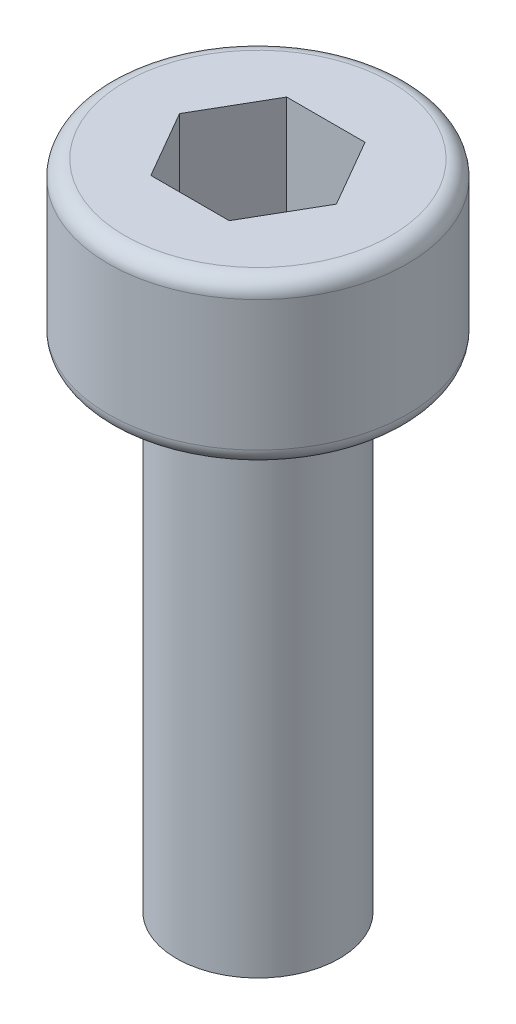
ISO-10303-21;
HEADER;
FILE_DESCRIPTION(('STEP AP214'),'2;1');
FILE_NAME('part.step','',(''),(''),'','','');
FILE_SCHEMA(('AUTOMOTIVE_DESIGN { 1 0 10303 214 1 1 1 1 }'));
ENDSEC;
DATA;
#1=APPLICATION_CONTEXT('core data for automotive mechanical design processes');
#2=APPLICATION_PROTOCOL_DEFINITION('international standard','automotive_design',2000,#1);
#3=PRODUCT_CONTEXT('',#1,'mechanical');
#4=PRODUCT('Part','Part','',(#3));
#5=PRODUCT_RELATED_PRODUCT_CATEGORY('part','',(#4));
#6=PRODUCT_DEFINITION_FORMATION('','',#4);
#7=PRODUCT_DEFINITION_CONTEXT('part definition',#1,'design');
#8=PRODUCT_DEFINITION('design','',#6,#7);
#9=PRODUCT_DEFINITION_SHAPE('','',#8);
#10=(LENGTH_UNIT() NAMED_UNIT(*) SI_UNIT(.MILLI.,.METRE.));
#11=(NAMED_UNIT(*) PLANE_ANGLE_UNIT() SI_UNIT($,.RADIAN.));
#12=(NAMED_UNIT(*) SI_UNIT($,.STERADIAN.) SOLID_ANGLE_UNIT());
#13=UNCERTAINTY_MEASURE_WITH_UNIT(LENGTH_MEASURE(1.E-05),#10,'distance_accuracy_value','');
#14=(GEOMETRIC_REPRESENTATION_CONTEXT(3) GLOBAL_UNCERTAINTY_ASSIGNED_CONTEXT((#13)) GLOBAL_UNIT_ASSIGNED_CONTEXT((#10,
#11,#12)) REPRESENTATION_CONTEXT('',''));
#15=CARTESIAN_POINT('',(0.,0.,0.));
#16=DIRECTION('',(0.,0.,1.));
#17=DIRECTION('',(1.,0.,0.));
#18=AXIS2_PLACEMENT_3D('',#15,#16,#17);
#19=CARTESIAN_POINT('',(-0.721687836487033,10.,-1.25));
#20=DIRECTION('',(-0.866025403784439,0.,-0.5));
#21=DIRECTION('',(-0.5,0.,0.866025403784439));
#22=AXIS2_PLACEMENT_3D('',#19,#20,#21);
#23=PLANE('',#22);
#24=DIRECTION('',(0.,1.,0.));
#25=VECTOR('',#24,1.);
#26=CARTESIAN_POINT('',(-1.44337567297406,10.,0.));
#27=LINE('',#26,#25);
#28=CARTESIAN_POINT('',(-1.44337567297406,12.,0.));
#29=VERTEX_POINT('',#28);
#30=CARTESIAN_POINT('',(-1.44337567297406,10.,0.));
#31=VERTEX_POINT('',#30);
#32=EDGE_CURVE('E102',#29,#31,#27,.F.);
#33=ORIENTED_EDGE('',*,*,#32,.T.);
#34=DIRECTION('',(-0.5,0.,0.866025403784439));
#35=VECTOR('',#34,1.);
#36=CARTESIAN_POINT('',(-0.721687836487033,10.,-1.25));
#37=LINE('',#36,#35);
#38=CARTESIAN_POINT('',(-0.721687836487033,10.,-1.25));
#39=VERTEX_POINT('',#38);
#40=EDGE_CURVE('E91',#39,#31,#37,.T.);
#41=ORIENTED_EDGE('',*,*,#40,.F.);
#42=DIRECTION('',(0.,1.,0.));
#43=VECTOR('',#42,1.);
#44=CARTESIAN_POINT('',(-0.721687836487033,10.,-1.25));
#45=LINE('',#44,#43);
#46=CARTESIAN_POINT('',(-0.721687836487033,12.,-1.25));
#47=VERTEX_POINT('',#46);
#48=EDGE_CURVE('E111',#39,#47,#45,.T.);
#49=ORIENTED_EDGE('',*,*,#48,.T.);
#50=DIRECTION('',(-0.5,0.,0.866025403784439));
#51=VECTOR('',#50,1.);
#52=CARTESIAN_POINT('',(-0.721687836487033,12.,-1.25));
#53=LINE('',#52,#51);
#54=EDGE_CURVE('E86',#29,#47,#53,.F.);
#55=ORIENTED_EDGE('',*,*,#54,.F.);
#56=EDGE_LOOP('',(#33,#41,#49,#55));
#57=FACE_BOUND('',#56,.T.);
#58=ADVANCED_FACE('F16',(#57),#23,.F.);
#59=CARTESIAN_POINT('',(-1.44337567297406,10.,0.));
#60=DIRECTION('',(-0.866025403784439,0.,0.5));
#61=DIRECTION('',(0.5,0.,0.866025403784439));
#62=AXIS2_PLACEMENT_3D('',#59,#60,#61);
#63=PLANE('',#62);
#64=DIRECTION('',(0.,-1.,0.));
#65=VECTOR('',#64,1.);
#66=CARTESIAN_POINT('',(-0.721687836487032,10.,1.25));
#67=LINE('',#66,#65);
#68=CARTESIAN_POINT('',(-0.721687836487032,12.,1.25));
#69=VERTEX_POINT('',#68);
#70=CARTESIAN_POINT('',(-0.721687836487032,10.,1.25));
#71=VERTEX_POINT('',#70);
#72=EDGE_CURVE('E107',#69,#71,#67,.T.);
#73=ORIENTED_EDGE('',*,*,#72,.T.);
#74=DIRECTION('',(0.5,0.,0.866025403784439));
#75=VECTOR('',#74,1.);
#76=CARTESIAN_POINT('',(-1.44337567297406,10.,0.));
#77=LINE('',#76,#75);
#78=EDGE_CURVE('E95',#31,#71,#77,.T.);
#79=ORIENTED_EDGE('',*,*,#78,.F.);
#80=ORIENTED_EDGE('',*,*,#32,.F.);
#81=DIRECTION('',(0.5,0.,0.866025403784439));
#82=VECTOR('',#81,1.);
#83=CARTESIAN_POINT('',(-1.44337567297406,12.,0.));
#84=LINE('',#83,#82);
#85=EDGE_CURVE('E109',#69,#29,#84,.F.);
#86=ORIENTED_EDGE('',*,*,#85,.F.);
#87=EDGE_LOOP('',(#73,#79,#80,#86));
#88=FACE_BOUND('',#87,.T.);
#89=ADVANCED_FACE('F105',(#88),#63,.F.);
#90=CARTESIAN_POINT('',(0.721687836487032,10.,-1.25));
#91=DIRECTION('',(0.,0.,-1.));
#92=DIRECTION('',(-1.,0.,0.));
#93=AXIS2_PLACEMENT_3D('',#90,#91,#92);
#94=PLANE('',#93);
#95=ORIENTED_EDGE('',*,*,#48,.F.);
#96=DIRECTION('',(1.,0.,0.));
#97=VECTOR('',#96,1.);
#98=CARTESIAN_POINT('',(0.,10.,-1.25));
#99=LINE('',#98,#97);
#100=CARTESIAN_POINT('',(0.721687836487031,10.,-1.25));
#101=VERTEX_POINT('',#100);
#102=EDGE_CURVE('E98',#101,#39,#99,.F.);
#103=ORIENTED_EDGE('',*,*,#102,.F.);
#104=DIRECTION('',(0.,1.,0.));
#105=VECTOR('',#104,1.);
#106=CARTESIAN_POINT('',(0.721687836487031,10.,-1.25));
#107=LINE('',#106,#105);
#108=CARTESIAN_POINT('',(0.721687836487031,12.,-1.25));
#109=VERTEX_POINT('',#108);
#110=EDGE_CURVE('E250',#101,#109,#107,.T.);
#111=ORIENTED_EDGE('',*,*,#110,.T.);
#112=DIRECTION('',(-1.,0.,0.));
#113=VECTOR('',#112,1.);
#114=CARTESIAN_POINT('',(0.721687836487032,12.,-1.25));
#115=LINE('',#114,#113);
#116=EDGE_CURVE('E262',#47,#109,#115,.F.);
#117=ORIENTED_EDGE('',*,*,#116,.F.);
#118=EDGE_LOOP('',(#95,#103,#111,#117));
#119=FACE_BOUND('',#118,.T.);
#120=ADVANCED_FACE('F265',(#119),#94,.F.);
#121=CARTESIAN_POINT('',(-0.721687836487032,10.,1.25));
#122=DIRECTION('',(0.,0.,1.));
#123=DIRECTION('',(0.,-1.,0.));
#124=AXIS2_PLACEMENT_3D('',#121,#122,#123);
#125=PLANE('',#124);
#126=DIRECTION('',(0.,1.,0.));
#127=VECTOR('',#126,1.);
#128=CARTESIAN_POINT('',(0.721687836487033,10.,1.25));
#129=LINE('',#128,#127);
#130=CARTESIAN_POINT('',(0.721687836487033,12.,1.25));
#131=VERTEX_POINT('',#130);
#132=CARTESIAN_POINT('',(0.721687836487033,10.,1.25));
#133=VERTEX_POINT('',#132);
#134=EDGE_CURVE('E246',#131,#133,#129,.F.);
#135=ORIENTED_EDGE('',*,*,#134,.T.);
#136=DIRECTION('',(1.,0.,0.));
#137=VECTOR('',#136,1.);
#138=CARTESIAN_POINT('',(0.,10.,1.25));
#139=LINE('',#138,#137);
#140=EDGE_CURVE('E256',#71,#133,#139,.T.);
#141=ORIENTED_EDGE('',*,*,#140,.F.);
#142=ORIENTED_EDGE('',*,*,#72,.F.);
#143=DIRECTION('',(1.,0.,0.));
#144=VECTOR('',#143,1.);
#145=CARTESIAN_POINT('',(-0.721687836487032,12.,1.25));
#146=LINE('',#145,#144);
#147=EDGE_CURVE('E258',#131,#69,#146,.F.);
#148=ORIENTED_EDGE('',*,*,#147,.F.);
#149=EDGE_LOOP('',(#135,#141,#142,#148));
#150=FACE_BOUND('',#149,.T.);
#151=ADVANCED_FACE('F274',(#150),#125,.F.);
#152=CARTESIAN_POINT('',(0.,10.,0.));
#153=DIRECTION('',(0.,1.,0.));
#154=DIRECTION('',(0.,0.,1.));
#155=AXIS2_PLACEMENT_3D('',#152,#153,#154);
#156=PLANE('',#155);
#157=ORIENTED_EDGE('',*,*,#40,.T.);
#158=ORIENTED_EDGE('',*,*,#78,.T.);
#159=ORIENTED_EDGE('',*,*,#140,.T.);
#160=DIRECTION('',(0.5,0.,-0.866025403784439));
#161=VECTOR('',#160,1.);
#162=CARTESIAN_POINT('',(0.721687836487032,10.,1.25));
#163=LINE('',#162,#161);
#164=CARTESIAN_POINT('',(1.44337567297406,10.,0.));
#165=VERTEX_POINT('',#164);
#166=EDGE_CURVE('E244',#133,#165,#163,.T.);
#167=ORIENTED_EDGE('',*,*,#166,.T.);
#168=DIRECTION('',(-0.5,0.,-0.866025403784438));
#169=VECTOR('',#168,1.);
#170=CARTESIAN_POINT('',(1.44337567297406,10.,0.));
#171=LINE('',#170,#169);
#172=EDGE_CURVE('E253',#165,#101,#171,.T.);
#173=ORIENTED_EDGE('',*,*,#172,.T.);
#174=ORIENTED_EDGE('',*,*,#102,.T.);
#175=EDGE_LOOP('',(#157,#158,#159,#167,#173,#174));
#176=FACE_BOUND('',#175,.T.);
#177=ADVANCED_FACE('F92',(#176),#156,.T.);
#178=CARTESIAN_POINT('',(1.44337567297406,10.,0.));
#179=DIRECTION('',(0.866025403784438,0.,-0.5));
#180=DIRECTION('',(-0.5,0.,-0.866025403784438));
#181=AXIS2_PLACEMENT_3D('',#178,#179,#180);
#182=PLANE('',#181);
#183=ORIENTED_EDGE('',*,*,#110,.F.);
#184=ORIENTED_EDGE('',*,*,#172,.F.);
#185=DIRECTION('',(0.,1.,0.));
#186=VECTOR('',#185,1.);
#187=CARTESIAN_POINT('',(1.44337567297406,10.,0.));
#188=LINE('',#187,#186);
#189=CARTESIAN_POINT('',(1.44337567297406,12.,0.));
#190=VERTEX_POINT('',#189);
#191=EDGE_CURVE('E235',#165,#190,#188,.T.);
#192=ORIENTED_EDGE('',*,*,#191,.T.);
#193=DIRECTION('',(-0.5,0.,-0.866025403784438));
#194=VECTOR('',#193,1.);
#195=CARTESIAN_POINT('',(1.44337567297406,12.,0.));
#196=LINE('',#195,#194);
#197=EDGE_CURVE('E248',#109,#190,#196,.F.);
#198=ORIENTED_EDGE('',*,*,#197,.F.);
#199=EDGE_LOOP('',(#183,#184,#192,#198));
#200=FACE_BOUND('',#199,.T.);
#201=ADVANCED_FACE('F281',(#200),#182,.F.);
#202=CARTESIAN_POINT('',(0.721687836487032,10.,1.25));
#203=DIRECTION('',(0.866025403784439,0.,0.5));
#204=DIRECTION('',(0.5,0.,-0.866025403784439));
#205=AXIS2_PLACEMENT_3D('',#202,#203,#204);
#206=PLANE('',#205);
#207=ORIENTED_EDGE('',*,*,#191,.F.);
#208=ORIENTED_EDGE('',*,*,#166,.F.);
#209=ORIENTED_EDGE('',*,*,#134,.F.);
#210=DIRECTION('',(0.499999999999999,0.,-0.866025403784439));
#211=VECTOR('',#210,1.);
#212=CARTESIAN_POINT('',(0.721687836487033,12.,1.25));
#213=LINE('',#212,#211);
#214=EDGE_CURVE('E243',#131,#190,#213,.T.);
#215=ORIENTED_EDGE('',*,*,#214,.T.);
#216=EDGE_LOOP('',(#207,#208,#209,#215));
#217=FACE_BOUND('',#216,.T.);
#218=ADVANCED_FACE('F279',(#217),#206,.F.);
#219=CARTESIAN_POINT('',(0.,12.,-2.75));
#220=DIRECTION('',(0.,-1.,0.));
#221=DIRECTION('',(0.,0.,-1.));
#222=AXIS2_PLACEMENT_3D('',#219,#220,#221);
#223=PLANE('',#222);
#224=ORIENTED_EDGE('',*,*,#147,.T.);
#225=ORIENTED_EDGE('',*,*,#85,.T.);
#226=ORIENTED_EDGE('',*,*,#54,.T.);
#227=ORIENTED_EDGE('',*,*,#116,.T.);
#228=ORIENTED_EDGE('',*,*,#197,.T.);
#229=ORIENTED_EDGE('',*,*,#214,.F.);
#230=EDGE_LOOP('',(#224,#225,#226,#227,#228,#229));
#231=FACE_BOUND('',#230,.T.);
#232=CARTESIAN_POINT('',(0.,12.,0.));
#233=DIRECTION('',(0.,-1.,0.));
#234=DIRECTION('',(0.,0.,-1.));
#235=AXIS2_PLACEMENT_3D('',#232,#233,#234);
#236=CIRCLE('',#235,2.45);
#237=CARTESIAN_POINT('',(0.,12.,-2.45));
#238=VERTEX_POINT('',#237);
#239=CARTESIAN_POINT('',(0.,12.,2.45));
#240=VERTEX_POINT('',#239);
#241=EDGE_CURVE('E413',#238,#240,#236,.T.);
#242=ORIENTED_EDGE('',*,*,#241,.F.);
#243=CARTESIAN_POINT('',(0.,12.,0.));
#244=DIRECTION('',(0.,-1.,0.));
#245=DIRECTION('',(0.,0.,1.));
#246=AXIS2_PLACEMENT_3D('',#243,#244,#245);
#247=CIRCLE('',#246,2.45);
#248=EDGE_CURVE('E412',#240,#238,#247,.T.);
#249=ORIENTED_EDGE('',*,*,#248,.F.);
#250=EDGE_LOOP('',(#242,#249));
#251=FACE_BOUND('',#250,.T.);
#252=ADVANCED_FACE('F223',(#231,#251),#223,.F.);
#253=CARTESIAN_POINT('',(0.,11.7,0.));
#254=DIRECTION('',(0.,-1.,0.));
#255=DIRECTION('',(0.,0.,-1.));
#256=AXIS2_PLACEMENT_3D('',#253,#254,#255);
#257=TOROIDAL_SURFACE('',#256,2.45,0.3);
#258=ORIENTED_EDGE('',*,*,#241,.T.);
#259=ORIENTED_EDGE('',*,*,#248,.T.);
#260=EDGE_LOOP('',(#258,#259));
#261=FACE_BOUND('',#260,.T.);
#262=CARTESIAN_POINT('',(0.,11.7,0.));
#263=DIRECTION('',(0.,1.,0.));
#264=DIRECTION('',(0.,0.,1.));
#265=AXIS2_PLACEMENT_3D('',#262,#263,#264);
#266=CIRCLE('',#265,2.75);
#267=CARTESIAN_POINT('',(0.,11.7,2.75));
#268=VERTEX_POINT('',#267);
#269=EDGE_CURVE('E214',#268,#268,#266,.F.);
#270=ORIENTED_EDGE('',*,*,#269,.F.);
#271=EDGE_LOOP('',(#270));
#272=FACE_BOUND('',#271,.T.);
#273=ADVANCED_FACE('F218',(#261,#272),#257,.T.);
#274=CARTESIAN_POINT('',(0.,12.,0.));
#275=DIRECTION('',(0.,1.,0.));
#276=DIRECTION('',(0.,0.,1.));
#277=AXIS2_PLACEMENT_3D('',#274,#275,#276);
#278=CYLINDRICAL_SURFACE('',#277,2.75);
#279=CARTESIAN_POINT('',(0.,9.3,0.));
#280=DIRECTION('',(0.,1.,0.));
#281=DIRECTION('',(0.,0.,1.));
#282=AXIS2_PLACEMENT_3D('',#279,#280,#281);
#283=CIRCLE('',#282,2.75);
#284=CARTESIAN_POINT('',(0.,9.3,2.75));
#285=VERTEX_POINT('',#284);
#286=EDGE_CURVE('E205',#285,#285,#283,.F.);
#287=ORIENTED_EDGE('',*,*,#286,.F.);
#288=EDGE_LOOP('',(#287));
#289=FACE_BOUND('',#288,.T.);
#290=ORIENTED_EDGE('',*,*,#269,.T.);
#291=EDGE_LOOP('',(#290));
#292=FACE_BOUND('',#291,.T.);
#293=ADVANCED_FACE('F222',(#289,#292),#278,.T.);
#294=CARTESIAN_POINT('',(0.,9.3,0.));
#295=DIRECTION('',(0.,1.,0.));
#296=DIRECTION('',(0.,0.,1.));
#297=AXIS2_PLACEMENT_3D('',#294,#295,#296);
#298=TOROIDAL_SURFACE('',#297,2.45,0.3);
#299=CARTESIAN_POINT('',(0.,9.,0.));
#300=DIRECTION('',(0.,1.,0.));
#301=DIRECTION('',(0.,0.,1.));
#302=AXIS2_PLACEMENT_3D('',#299,#300,#301);
#303=CIRCLE('',#302,2.45);
#304=CARTESIAN_POINT('',(0.,9.,2.45));
#305=VERTEX_POINT('',#304);
#306=CARTESIAN_POINT('',(0.,9.,-2.45));
#307=VERTEX_POINT('',#306);
#308=EDGE_CURVE('E213',#305,#307,#303,.T.);
#309=ORIENTED_EDGE('',*,*,#308,.T.);
#310=CARTESIAN_POINT('',(0.,9.,0.));
#311=DIRECTION('',(0.,1.,0.));
#312=DIRECTION('',(0.,0.,-1.));
#313=AXIS2_PLACEMENT_3D('',#310,#311,#312);
#314=CIRCLE('',#313,2.45);
#315=EDGE_CURVE('E180',#307,#305,#314,.T.);
#316=ORIENTED_EDGE('',*,*,#315,.T.);
#317=EDGE_LOOP('',(#309,#316));
#318=FACE_BOUND('',#317,.T.);
#319=ORIENTED_EDGE('',*,*,#286,.T.);
#320=EDGE_LOOP('',(#319));
#321=FACE_BOUND('',#320,.T.);
#322=ADVANCED_FACE('F157',(#318,#321),#298,.T.);
#323=CARTESIAN_POINT('',(0.,9.,-1.5));
#324=DIRECTION('',(0.,1.,0.));
#325=DIRECTION('',(0.,0.,1.));
#326=AXIS2_PLACEMENT_3D('',#323,#324,#325);
#327=PLANE('',#326);
#328=ORIENTED_EDGE('',*,*,#308,.F.);
#329=ORIENTED_EDGE('',*,*,#315,.F.);
#330=EDGE_LOOP('',(#328,#329));
#331=FACE_BOUND('',#330,.T.);
#332=CARTESIAN_POINT('',(0.,9.,0.));
#333=DIRECTION('',(0.,-1.,0.));
#334=DIRECTION('',(0.,0.,1.));
#335=AXIS2_PLACEMENT_3D('',#332,#333,#334);
#336=CIRCLE('',#335,1.8);
#337=CARTESIAN_POINT('',(0.,9.,-1.8));
#338=VERTEX_POINT('',#337);
#339=CARTESIAN_POINT('',(0.,9.,1.8));
#340=VERTEX_POINT('',#339);
#341=EDGE_CURVE('E120',#338,#340,#336,.F.);
#342=ORIENTED_EDGE('',*,*,#341,.T.);
#343=CARTESIAN_POINT('',(0.,9.,0.));
#344=DIRECTION('',(0.,-1.,0.));
#345=DIRECTION('',(0.,0.,-1.));
#346=AXIS2_PLACEMENT_3D('',#343,#344,#345);
#347=CIRCLE('',#346,1.8);
#348=EDGE_CURVE('E35',#340,#338,#347,.F.);
#349=ORIENTED_EDGE('',*,*,#348,.T.);
#350=EDGE_LOOP('',(#342,#349));
#351=FACE_BOUND('',#350,.T.);
#352=ADVANCED_FACE('F148',(#331,#351),#327,.F.);
#353=CARTESIAN_POINT('',(0.,0.,0.));
#354=DIRECTION('',(0.,1.,0.));
#355=DIRECTION('',(0.,0.,1.));
#356=AXIS2_PLACEMENT_3D('',#353,#354,#355);
#357=PLANE('',#356);
#358=CARTESIAN_POINT('',(0.,0.,0.));
#359=DIRECTION('',(0.,1.,0.));
#360=DIRECTION('',(0.,0.,1.));
#361=AXIS2_PLACEMENT_3D('',#358,#359,#360);
#362=CIRCLE('',#361,1.5);
#363=CARTESIAN_POINT('',(0.,0.,1.5));
#364=VERTEX_POINT('',#363);
#365=EDGE_CURVE('E27',#364,#364,#362,.T.);
#366=ORIENTED_EDGE('',*,*,#365,.F.);
#367=EDGE_LOOP('',(#366));
#368=FACE_BOUND('',#367,.T.);
#369=ADVANCED_FACE('F138',(#368),#357,.F.);
#370=CARTESIAN_POINT('',(0.,8.7,0.));
#371=DIRECTION('',(0.,1.,0.));
#372=DIRECTION('',(0.,0.,1.));
#373=AXIS2_PLACEMENT_3D('',#370,#371,#372);
#374=TOROIDAL_SURFACE('',#373,1.8,0.3);
#375=ORIENTED_EDGE('',*,*,#348,.F.);
#376=ORIENTED_EDGE('',*,*,#341,.F.);
#377=EDGE_LOOP('',(#375,#376));
#378=FACE_BOUND('',#377,.T.);
#379=CARTESIAN_POINT('',(0.,8.7,0.));
#380=DIRECTION('',(0.,1.,0.));
#381=DIRECTION('',(0.,0.,1.));
#382=AXIS2_PLACEMENT_3D('',#379,#380,#381);
#383=CIRCLE('',#382,1.5);
#384=CARTESIAN_POINT('',(0.,8.7,1.5));
#385=VERTEX_POINT('',#384);
#386=EDGE_CURVE('E11',#385,#385,#383,.F.);
#387=ORIENTED_EDGE('',*,*,#386,.F.);
#388=EDGE_LOOP('',(#387));
#389=FACE_BOUND('',#388,.T.);
#390=ADVANCED_FACE('F126',(#378,#389),#374,.F.);
#391=CARTESIAN_POINT('',(0.,12.,0.));
#392=DIRECTION('',(0.,1.,0.));
#393=DIRECTION('',(0.,0.,1.));
#394=AXIS2_PLACEMENT_3D('',#391,#392,#393);
#395=CYLINDRICAL_SURFACE('',#394,1.5);
#396=ORIENTED_EDGE('',*,*,#386,.T.);
#397=EDGE_LOOP('',(#396));
#398=FACE_BOUND('',#397,.T.);
#399=ORIENTED_EDGE('',*,*,#365,.T.);
#400=EDGE_LOOP('',(#399));
#401=FACE_BOUND('',#400,.T.);
#402=ADVANCED_FACE('F137',(#398,#401),#395,.T.);
#403=CLOSED_SHELL('',(#58,#89,#120,#151,#177,#201,#218,#252,#273,#293,#322,#352,#369,#390,#402));
#404=MANIFOLD_SOLID_BREP('B1',#403);
#405=ADVANCED_BREP_SHAPE_REPRESENTATION('',(#18,#404),#14);
#406=SHAPE_DEFINITION_REPRESENTATION(#9,#405);
ENDSEC;
END-ISO-10303-21;
